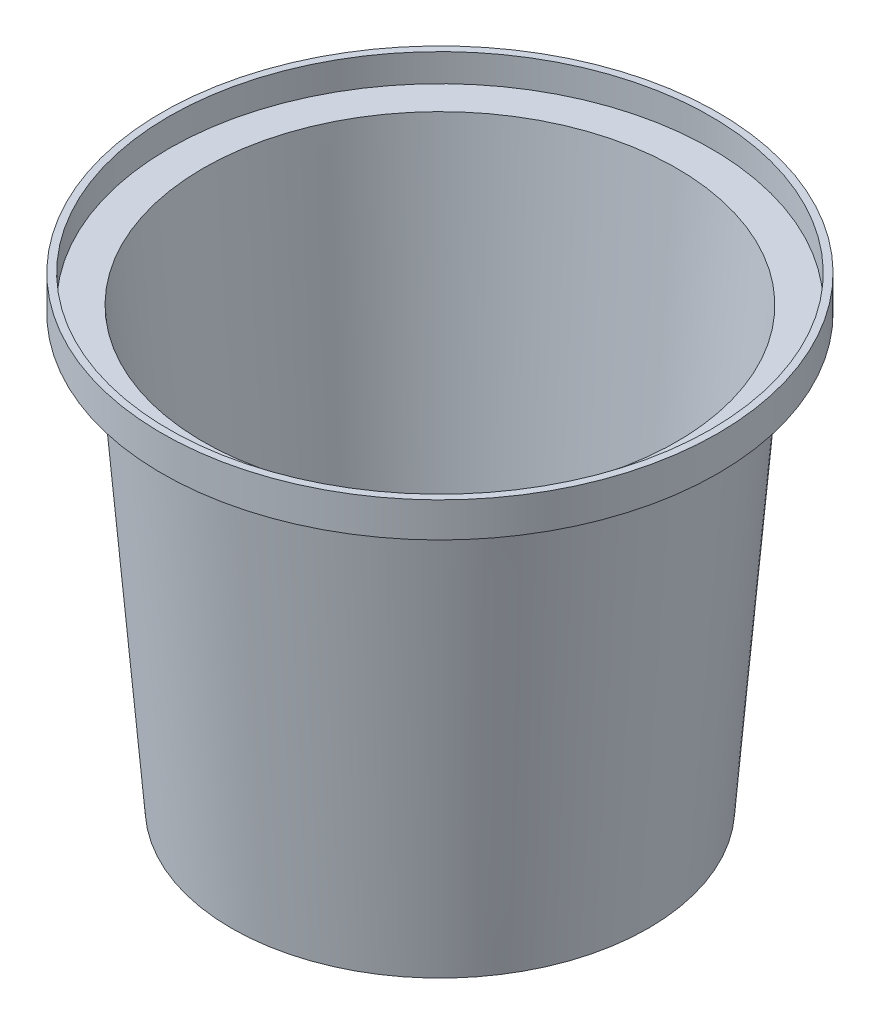
ISO-10303-21;
HEADER;
FILE_DESCRIPTION(('STEP AP214'),'2;1');
FILE_NAME('part.step','',(''),(''),'','','');
FILE_SCHEMA(('AUTOMOTIVE_DESIGN { 1 0 10303 214 1 1 1 1 }'));
ENDSEC;
DATA;
#1=APPLICATION_CONTEXT('core data for automotive mechanical design processes');
#2=APPLICATION_PROTOCOL_DEFINITION('international standard','automotive_design',2000,#1);
#3=PRODUCT_CONTEXT('',#1,'mechanical');
#4=PRODUCT('Part','Part','',(#3));
#5=PRODUCT_RELATED_PRODUCT_CATEGORY('part','',(#4));
#6=PRODUCT_DEFINITION_FORMATION('','',#4);
#7=PRODUCT_DEFINITION_CONTEXT('part definition',#1,'design');
#8=PRODUCT_DEFINITION('design','',#6,#7);
#9=PRODUCT_DEFINITION_SHAPE('','',#8);
#10=(LENGTH_UNIT() NAMED_UNIT(*) SI_UNIT(.MILLI.,.METRE.));
#11=(NAMED_UNIT(*) PLANE_ANGLE_UNIT() SI_UNIT($,.RADIAN.));
#12=(NAMED_UNIT(*) SI_UNIT($,.STERADIAN.) SOLID_ANGLE_UNIT());
#13=UNCERTAINTY_MEASURE_WITH_UNIT(LENGTH_MEASURE(1.E-05),#10,'distance_accuracy_value','');
#14=(GEOMETRIC_REPRESENTATION_CONTEXT(3) GLOBAL_UNCERTAINTY_ASSIGNED_CONTEXT((#13)) GLOBAL_UNIT_ASSIGNED_CONTEXT((#10,
#11,#12)) REPRESENTATION_CONTEXT('',''));
#15=CARTESIAN_POINT('',(0.,0.,0.));
#16=DIRECTION('',(0.,0.,1.));
#17=DIRECTION('',(1.,0.,0.));
#18=AXIS2_PLACEMENT_3D('',#15,#16,#17);
#19=CARTESIAN_POINT('',(0.,1.54361204949859E-13,0.));
#20=DIRECTION('',(0.,1.,0.));
#21=DIRECTION('',(-1.,0.,0.));
#22=AXIS2_PLACEMENT_3D('',#19,#20,#21);
#23=PLANE('',#22);
#24=CARTESIAN_POINT('',(0.,3.33066907387547E-13,0.));
#25=DIRECTION('',(0.,-1.,0.));
#26=DIRECTION('',(1.,0.,0.));
#27=AXIS2_PLACEMENT_3D('',#24,#25,#26);
#28=CIRCLE('',#27,90.);
#29=CARTESIAN_POINT('',(90.,6.41789317287266E-13,0.));
#30=VERTEX_POINT('',#29);
#31=EDGE_CURVE('E10',#30,#30,#28,.T.);
#32=ORIENTED_EDGE('',*,*,#31,.T.);
#33=EDGE_LOOP('',(#32));
#34=FACE_BOUND('',#33,.T.);
#35=ADVANCED_FACE('F36',(#34),#23,.F.);
#36=CARTESIAN_POINT('',(-6.34596064793869E-13,185.000000000001,0.));
#37=DIRECTION('',(0.,1.,0.));
#38=DIRECTION('',(-1.,0.,0.));
#39=AXIS2_PLACEMENT_3D('',#36,#37,#38);
#40=CONICAL_SURFACE('',#39,104.999999999999,0.0809040991552271);
#41=ORIENTED_EDGE('',*,*,#31,.F.);
#42=EDGE_LOOP('',(#41));
#43=FACE_BOUND('',#42,.T.);
#44=CARTESIAN_POINT('',(-6.34596064793869E-13,185.000000000001,0.));
#45=DIRECTION('',(0.,-1.,0.));
#46=DIRECTION('',(1.,0.,0.));
#47=AXIS2_PLACEMENT_3D('',#44,#45,#46);
#48=CIRCLE('',#47,104.999999999999);
#49=CARTESIAN_POINT('',(104.999999999999,185.000000000001,0.));
#50=VERTEX_POINT('',#49);
#51=EDGE_CURVE('E42',#50,#50,#48,.T.);
#52=ORIENTED_EDGE('',*,*,#51,.T.);
#53=EDGE_LOOP('',(#52));
#54=FACE_BOUND('',#53,.T.);
#55=ADVANCED_FACE('F85',(#43,#54),#40,.T.);
#56=CARTESIAN_POINT('',(-105.,185.,0.));
#57=DIRECTION('',(0.,1.,0.));
#58=DIRECTION('',(-1.,0.,0.));
#59=AXIS2_PLACEMENT_3D('',#56,#57,#58);
#60=PLANE('',#59);
#61=ORIENTED_EDGE('',*,*,#51,.F.);
#62=EDGE_LOOP('',(#61));
#63=FACE_BOUND('',#62,.T.);
#64=CARTESIAN_POINT('',(-6.34596064793869E-13,185.000000000001,0.));
#65=DIRECTION('',(0.,-1.,0.));
#66=DIRECTION('',(1.,0.,0.));
#67=AXIS2_PLACEMENT_3D('',#64,#65,#66);
#68=CIRCLE('',#67,119.999999999999);
#69=CARTESIAN_POINT('',(119.999999999999,185.000000000001,0.));
#70=VERTEX_POINT('',#69);
#71=EDGE_CURVE('E46',#70,#70,#68,.T.);
#72=ORIENTED_EDGE('',*,*,#71,.T.);
#73=EDGE_LOOP('',(#72));
#74=FACE_BOUND('',#73,.T.);
#75=ADVANCED_FACE('F89',(#63,#74),#60,.F.);
#76=CARTESIAN_POINT('',(3.01512578240594E-12,-878.981608444555,0.));
#77=DIRECTION('',(0.,-1.,0.));
#78=DIRECTION('',(1.,0.,0.));
#79=AXIS2_PLACEMENT_3D('',#76,#77,#78);
#80=CYLINDRICAL_SURFACE('',#79,119.999999999999);
#81=ORIENTED_EDGE('',*,*,#71,.F.);
#82=EDGE_LOOP('',(#81));
#83=FACE_BOUND('',#82,.T.);
#84=CARTESIAN_POINT('',(-6.86049799777155E-13,200.,0.));
#85=DIRECTION('',(0.,-1.,0.));
#86=DIRECTION('',(1.,0.,0.));
#87=AXIS2_PLACEMENT_3D('',#84,#85,#86);
#88=CIRCLE('',#87,119.999999999999);
#89=CARTESIAN_POINT('',(119.999999999999,200.000000000001,0.));
#90=VERTEX_POINT('',#89);
#91=EDGE_CURVE('E50',#90,#90,#88,.T.);
#92=ORIENTED_EDGE('',*,*,#91,.T.);
#93=EDGE_LOOP('',(#92));
#94=FACE_BOUND('',#93,.T.);
#95=ADVANCED_FACE('F81',(#83,#94),#80,.T.);
#96=CARTESIAN_POINT('',(-120.,200.,0.));
#97=DIRECTION('',(0.,-1.,0.));
#98=DIRECTION('',(1.,0.,0.));
#99=AXIS2_PLACEMENT_3D('',#96,#97,#98);
#100=PLANE('',#99);
#101=CARTESIAN_POINT('',(-6.86049799777154E-13,200.,0.));
#102=DIRECTION('',(0.,-1.,0.));
#103=DIRECTION('',(1.,0.,0.));
#104=AXIS2_PLACEMENT_3D('',#101,#102,#103);
#105=CIRCLE('',#104,116.999999999999);
#106=CARTESIAN_POINT('',(116.999999999999,200.000000000001,0.));
#107=VERTEX_POINT('',#106);
#108=EDGE_CURVE('E56',#107,#107,#105,.T.);
#109=ORIENTED_EDGE('',*,*,#108,.T.);
#110=EDGE_LOOP('',(#109));
#111=FACE_BOUND('',#110,.T.);
#112=ORIENTED_EDGE('',*,*,#91,.F.);
#113=EDGE_LOOP('',(#112));
#114=FACE_BOUND('',#113,.T.);
#115=ADVANCED_FACE('F73',(#111,#114),#100,.F.);
#116=CARTESIAN_POINT('',(0.,3.00000000000015,0.));
#117=DIRECTION('',(0.,1.,0.));
#118=DIRECTION('',(-1.,0.,0.));
#119=AXIS2_PLACEMENT_3D('',#116,#117,#118);
#120=PLANE('',#119);
#121=CARTESIAN_POINT('',(0.,3.00000000000014,0.));
#122=DIRECTION('',(0.,1.,0.));
#123=DIRECTION('',(-1.,0.,0.));
#124=AXIS2_PLACEMENT_3D('',#121,#122,#123);
#125=CIRCLE('',#124,87.233398184875);
#126=CARTESIAN_POINT('',(-87.233398184875,2.99999999999984,0.));
#127=VERTEX_POINT('',#126);
#128=EDGE_CURVE('E55',#127,#127,#125,.F.);
#129=ORIENTED_EDGE('',*,*,#128,.F.);
#130=EDGE_LOOP('',(#129));
#131=FACE_BOUND('',#130,.T.);
#132=ADVANCED_FACE('F71',(#131),#120,.T.);
#133=CARTESIAN_POINT('',(-6.35427720452655E-13,185.242447606299,0.));
#134=DIRECTION('',(0.,1.,0.));
#135=DIRECTION('',(-1.,0.,0.));
#136=AXIS2_PLACEMENT_3D('',#133,#134,#135);
#137=CONICAL_SURFACE('',#136,102.009812855655,0.0809040991552271);
#138=ORIENTED_EDGE('',*,*,#128,.T.);
#139=EDGE_LOOP('',(#138));
#140=FACE_BOUND('',#139,.T.);
#141=CARTESIAN_POINT('',(-6.44886811790526E-13,188.,0.));
#142=DIRECTION('',(0.,1.,0.));
#143=DIRECTION('',(-1.,0.,0.));
#144=AXIS2_PLACEMENT_3D('',#141,#142,#143);
#145=CIRCLE('',#144,102.233398184874);
#146=CARTESIAN_POINT('',(-102.233398184875,188.,0.));
#147=VERTEX_POINT('',#146);
#148=EDGE_CURVE('E62',#147,#147,#145,.F.);
#149=ORIENTED_EDGE('',*,*,#148,.F.);
#150=EDGE_LOOP('',(#149));
#151=FACE_BOUND('',#150,.T.);
#152=ADVANCED_FACE('F68',(#140,#151),#137,.F.);
#153=CARTESIAN_POINT('',(-105.,188.,0.));
#154=DIRECTION('',(0.,1.,0.));
#155=DIRECTION('',(-1.,0.,0.));
#156=AXIS2_PLACEMENT_3D('',#153,#154,#155);
#157=PLANE('',#156);
#158=ORIENTED_EDGE('',*,*,#148,.T.);
#159=EDGE_LOOP('',(#158));
#160=FACE_BOUND('',#159,.T.);
#161=CARTESIAN_POINT('',(-6.44886811790526E-13,188.,0.));
#162=DIRECTION('',(0.,1.,0.));
#163=DIRECTION('',(-1.,0.,0.));
#164=AXIS2_PLACEMENT_3D('',#161,#162,#163);
#165=CIRCLE('',#164,116.999999999999);
#166=CARTESIAN_POINT('',(-117.,188.,0.));
#167=VERTEX_POINT('',#166);
#168=EDGE_CURVE('E59',#167,#167,#165,.F.);
#169=ORIENTED_EDGE('',*,*,#168,.F.);
#170=EDGE_LOOP('',(#169));
#171=FACE_BOUND('',#170,.T.);
#172=ADVANCED_FACE('F79',(#160,#171),#157,.T.);
#173=CARTESIAN_POINT('',(3.01512578240594E-12,-878.981608444555,0.));
#174=DIRECTION('',(0.,-1.,0.));
#175=DIRECTION('',(1.,0.,0.));
#176=AXIS2_PLACEMENT_3D('',#173,#174,#175);
#177=CYLINDRICAL_SURFACE('',#176,116.999999999999);
#178=ORIENTED_EDGE('',*,*,#168,.T.);
#179=EDGE_LOOP('',(#178));
#180=FACE_BOUND('',#179,.T.);
#181=ORIENTED_EDGE('',*,*,#108,.F.);
#182=EDGE_LOOP('',(#181));
#183=FACE_BOUND('',#182,.T.);
#184=ADVANCED_FACE('F100',(#180,#183),#177,.F.);
#185=CLOSED_SHELL('',(#35,#55,#75,#95,#115,#132,#152,#172,#184));
#186=MANIFOLD_SOLID_BREP('B2',#185);
#187=ADVANCED_BREP_SHAPE_REPRESENTATION('',(#18,#186),#14);
#188=SHAPE_DEFINITION_REPRESENTATION(#9,#187);
ENDSEC;
END-ISO-10303-21;
